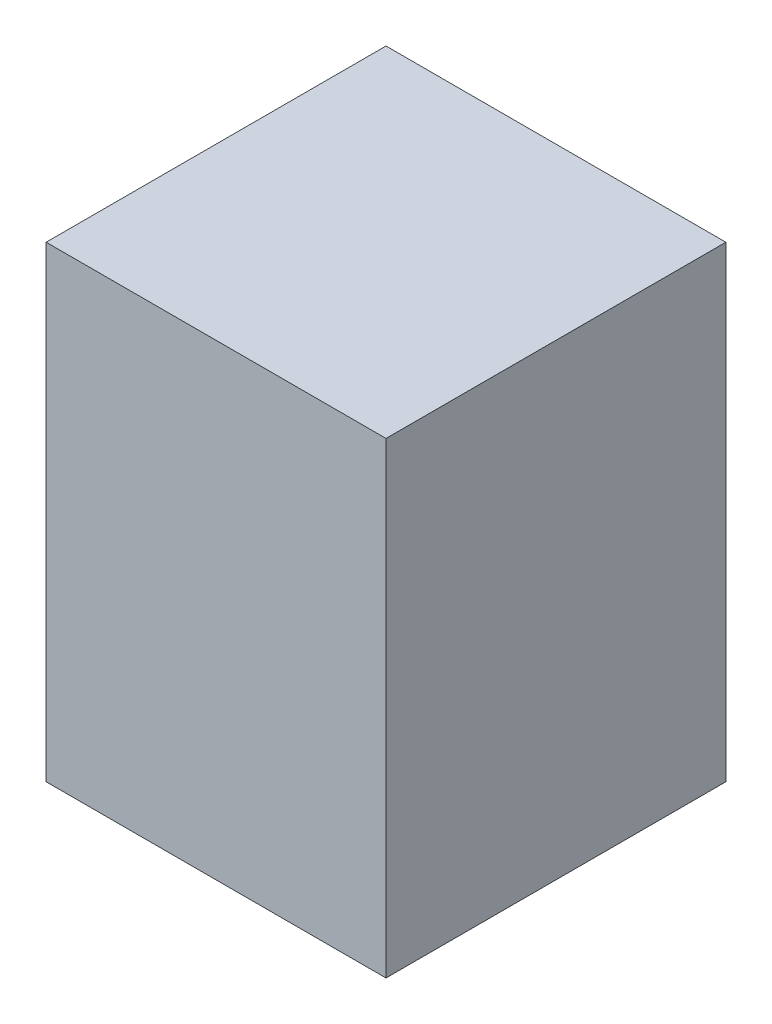
ISO-10303-21;
HEADER;
FILE_DESCRIPTION(('STEP AP214'),'2;1');
FILE_NAME('part.step','',(''),(''),'','','');
FILE_SCHEMA(('AUTOMOTIVE_DESIGN { 1 0 10303 214 1 1 1 1 }'));
ENDSEC;
DATA;
#1=APPLICATION_CONTEXT('core data for automotive mechanical design processes');
#2=APPLICATION_PROTOCOL_DEFINITION('international standard','automotive_design',2000,#1);
#3=PRODUCT_CONTEXT('',#1,'mechanical');
#4=PRODUCT('Part','Part','',(#3));
#5=PRODUCT_RELATED_PRODUCT_CATEGORY('part','',(#4));
#6=PRODUCT_DEFINITION_FORMATION('','',#4);
#7=PRODUCT_DEFINITION_CONTEXT('part definition',#1,'design');
#8=PRODUCT_DEFINITION('design','',#6,#7);
#9=PRODUCT_DEFINITION_SHAPE('','',#8);
#10=(LENGTH_UNIT() NAMED_UNIT(*) SI_UNIT(.MILLI.,.METRE.));
#11=(NAMED_UNIT(*) PLANE_ANGLE_UNIT() SI_UNIT($,.RADIAN.));
#12=(NAMED_UNIT(*) SI_UNIT($,.STERADIAN.) SOLID_ANGLE_UNIT());
#13=UNCERTAINTY_MEASURE_WITH_UNIT(LENGTH_MEASURE(1.E-05),#10,'distance_accuracy_value','');
#14=(GEOMETRIC_REPRESENTATION_CONTEXT(3) GLOBAL_UNCERTAINTY_ASSIGNED_CONTEXT((#13)) GLOBAL_UNIT_ASSIGNED_CONTEXT((#10,
#11,#12)) REPRESENTATION_CONTEXT('',''));
#15=CARTESIAN_POINT('',(0.,0.,0.));
#16=DIRECTION('',(0.,0.,1.));
#17=DIRECTION('',(1.,0.,0.));
#18=AXIS2_PLACEMENT_3D('',#15,#16,#17);
#19=CARTESIAN_POINT('',(-0.7999984,1.10000034,0.));
#20=DIRECTION('',(1.,0.,0.));
#21=DIRECTION('',(0.,0.,-1.));
#22=AXIS2_PLACEMENT_3D('',#19,#20,#21);
#23=PLANE('',#22);
#24=DIRECTION('',(0.,0.,1.));
#25=VECTOR('',#24,1.);
#26=CARTESIAN_POINT('',(-0.7999984,-1.10000034,0.));
#27=LINE('',#26,#25);
#28=CARTESIAN_POINT('',(-0.7999984,-1.10000034,0.));
#29=VERTEX_POINT('',#28);
#30=CARTESIAN_POINT('',(-0.7999984,-1.10000034,1.59999934));
#31=VERTEX_POINT('',#30);
#32=EDGE_CURVE('E20',#29,#31,#27,.T.);
#33=ORIENTED_EDGE('',*,*,#32,.T.);
#34=DIRECTION('',(0.,1.,0.));
#35=VECTOR('',#34,1.);
#36=CARTESIAN_POINT('',(-0.7999984,-1.10000034,1.59999934));
#37=LINE('',#36,#35);
#38=CARTESIAN_POINT('',(-0.7999984,1.10000034,1.59999934));
#39=VERTEX_POINT('',#38);
#40=EDGE_CURVE('E55',#31,#39,#37,.T.);
#41=ORIENTED_EDGE('',*,*,#40,.T.);
#42=DIRECTION('',(0.,0.,-1.));
#43=VECTOR('',#42,1.);
#44=CARTESIAN_POINT('',(-0.7999984,1.10000034,0.));
#45=LINE('',#44,#43);
#46=CARTESIAN_POINT('',(-0.7999984,1.10000034,0.));
#47=VERTEX_POINT('',#46);
#48=EDGE_CURVE('E74',#39,#47,#45,.T.);
#49=ORIENTED_EDGE('',*,*,#48,.T.);
#50=DIRECTION('',(0.,1.,0.));
#51=VECTOR('',#50,1.);
#52=CARTESIAN_POINT('',(-0.7999984,-1.10000034,0.));
#53=LINE('',#52,#51);
#54=EDGE_CURVE('E66',#29,#47,#53,.T.);
#55=ORIENTED_EDGE('',*,*,#54,.F.);
#56=EDGE_LOOP('',(#33,#41,#49,#55));
#57=FACE_BOUND('',#56,.T.);
#58=ADVANCED_FACE('F17',(#57),#23,.F.);
#59=CARTESIAN_POINT('',(-0.7999984,-1.10000034,0.));
#60=DIRECTION('',(0.,1.,0.));
#61=DIRECTION('',(0.,0.,1.));
#62=AXIS2_PLACEMENT_3D('',#59,#60,#61);
#63=PLANE('',#62);
#64=DIRECTION('',(0.,0.,1.));
#65=VECTOR('',#64,1.);
#66=CARTESIAN_POINT('',(0.80000094,-1.10000034,0.));
#67=LINE('',#66,#65);
#68=CARTESIAN_POINT('',(0.80000094,-1.10000034,0.));
#69=VERTEX_POINT('',#68);
#70=CARTESIAN_POINT('',(0.80000094,-1.10000034,1.59999934));
#71=VERTEX_POINT('',#70);
#72=EDGE_CURVE('E72',#69,#71,#67,.T.);
#73=ORIENTED_EDGE('',*,*,#72,.T.);
#74=DIRECTION('',(-1.,0.,0.));
#75=VECTOR('',#74,1.);
#76=CARTESIAN_POINT('',(-0.7999984,-1.10000034,1.59999934));
#77=LINE('',#76,#75);
#78=EDGE_CURVE('E62',#71,#31,#77,.T.);
#79=ORIENTED_EDGE('',*,*,#78,.T.);
#80=ORIENTED_EDGE('',*,*,#32,.F.);
#81=DIRECTION('',(-1.,0.,0.));
#82=VECTOR('',#81,1.);
#83=CARTESIAN_POINT('',(-0.7999984,-1.10000034,0.));
#84=LINE('',#83,#82);
#85=EDGE_CURVE('E80',#69,#29,#84,.T.);
#86=ORIENTED_EDGE('',*,*,#85,.F.);
#87=EDGE_LOOP('',(#73,#79,#80,#86));
#88=FACE_BOUND('',#87,.T.);
#89=ADVANCED_FACE('F71',(#88),#63,.F.);
#90=CARTESIAN_POINT('',(-0.7999984,-1.10000034,1.59999934));
#91=DIRECTION('',(0.,0.,-1.));
#92=DIRECTION('',(-1.,0.,0.));
#93=AXIS2_PLACEMENT_3D('',#90,#91,#92);
#94=PLANE('',#93);
#95=DIRECTION('',(0.,1.,0.));
#96=VECTOR('',#95,1.);
#97=CARTESIAN_POINT('',(0.80000094,-1.10000034,1.59999934));
#98=LINE('',#97,#96);
#99=CARTESIAN_POINT('',(0.80000094,1.10000034,1.59999934));
#100=VERTEX_POINT('',#99);
#101=EDGE_CURVE('E83',#71,#100,#98,.T.);
#102=ORIENTED_EDGE('',*,*,#101,.T.);
#103=DIRECTION('',(1.,0.,0.));
#104=VECTOR('',#103,1.);
#105=CARTESIAN_POINT('',(0.80000094,1.10000034,1.59999934));
#106=LINE('',#105,#104);
#107=EDGE_CURVE('E64',#100,#39,#106,.F.);
#108=ORIENTED_EDGE('',*,*,#107,.T.);
#109=ORIENTED_EDGE('',*,*,#40,.F.);
#110=ORIENTED_EDGE('',*,*,#78,.F.);
#111=EDGE_LOOP('',(#102,#108,#109,#110));
#112=FACE_BOUND('',#111,.T.);
#113=ADVANCED_FACE('F60',(#112),#94,.F.);
#114=CARTESIAN_POINT('',(0.80000094,1.10000034,0.));
#115=DIRECTION('',(0.,-1.,0.));
#116=DIRECTION('',(0.,0.,-1.));
#117=AXIS2_PLACEMENT_3D('',#114,#115,#116);
#118=PLANE('',#117);
#119=ORIENTED_EDGE('',*,*,#48,.F.);
#120=ORIENTED_EDGE('',*,*,#107,.F.);
#121=DIRECTION('',(0.,0.,1.));
#122=VECTOR('',#121,1.);
#123=CARTESIAN_POINT('',(0.80000094,1.10000034,0.));
#124=LINE('',#123,#122);
#125=CARTESIAN_POINT('',(0.80000094,1.10000034,0.));
#126=VERTEX_POINT('',#125);
#127=EDGE_CURVE('E26',#100,#126,#124,.F.);
#128=ORIENTED_EDGE('',*,*,#127,.T.);
#129=DIRECTION('',(-1.,0.,0.));
#130=VECTOR('',#129,1.);
#131=CARTESIAN_POINT('',(-0.7999984,1.10000034,0.));
#132=LINE('',#131,#130);
#133=EDGE_CURVE('E34',#47,#126,#132,.F.);
#134=ORIENTED_EDGE('',*,*,#133,.F.);
#135=EDGE_LOOP('',(#119,#120,#128,#134));
#136=FACE_BOUND('',#135,.T.);
#137=ADVANCED_FACE('F88',(#136),#118,.F.);
#138=CARTESIAN_POINT('',(-0.7999984,-1.10000034,0.));
#139=DIRECTION('',(0.,0.,-1.));
#140=DIRECTION('',(-1.,0.,0.));
#141=AXIS2_PLACEMENT_3D('',#138,#139,#140);
#142=PLANE('',#141);
#143=DIRECTION('',(0.,1.,0.));
#144=VECTOR('',#143,1.);
#145=CARTESIAN_POINT('',(0.80000094,-1.10000034,0.));
#146=LINE('',#145,#144);
#147=EDGE_CURVE('E11',#126,#69,#146,.F.);
#148=ORIENTED_EDGE('',*,*,#147,.T.);
#149=ORIENTED_EDGE('',*,*,#85,.T.);
#150=ORIENTED_EDGE('',*,*,#54,.T.);
#151=ORIENTED_EDGE('',*,*,#133,.T.);
#152=EDGE_LOOP('',(#148,#149,#150,#151));
#153=FACE_BOUND('',#152,.T.);
#154=ADVANCED_FACE('F91',(#153),#142,.T.);
#155=CARTESIAN_POINT('',(0.80000094,-1.10000034,0.));
#156=DIRECTION('',(-1.,0.,0.));
#157=DIRECTION('',(0.,0.,1.));
#158=AXIS2_PLACEMENT_3D('',#155,#156,#157);
#159=PLANE('',#158);
#160=ORIENTED_EDGE('',*,*,#127,.F.);
#161=ORIENTED_EDGE('',*,*,#101,.F.);
#162=ORIENTED_EDGE('',*,*,#72,.F.);
#163=ORIENTED_EDGE('',*,*,#147,.F.);
#164=EDGE_LOOP('',(#160,#161,#162,#163));
#165=FACE_BOUND('',#164,.T.);
#166=ADVANCED_FACE('F90',(#165),#159,.F.);
#167=CLOSED_SHELL('',(#58,#89,#113,#137,#154,#166));
#168=MANIFOLD_SOLID_BREP('B1',#167);
#169=ADVANCED_BREP_SHAPE_REPRESENTATION('',(#18,#168),#14);
#170=SHAPE_DEFINITION_REPRESENTATION(#9,#169);
ENDSEC;
END-ISO-10303-21;
